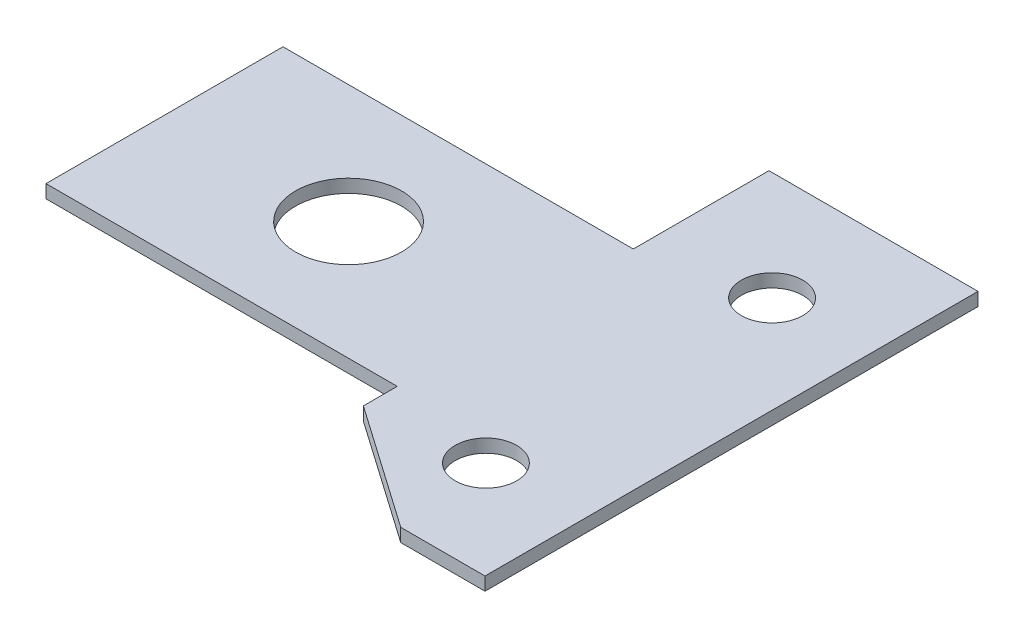
ISO-10303-21;
HEADER;
FILE_DESCRIPTION(('STEP AP214'),'2;1');
FILE_NAME('part.step','',(''),(''),'','','');
FILE_SCHEMA(('AUTOMOTIVE_DESIGN { 1 0 10303 214 1 1 1 1 }'));
ENDSEC;
DATA;
#1=APPLICATION_CONTEXT('core data for automotive mechanical design processes');
#2=APPLICATION_PROTOCOL_DEFINITION('international standard','automotive_design',2000,#1);
#3=PRODUCT_CONTEXT('',#1,'mechanical');
#4=PRODUCT('Part','Part','',(#3));
#5=PRODUCT_RELATED_PRODUCT_CATEGORY('part','',(#4));
#6=PRODUCT_DEFINITION_FORMATION('','',#4);
#7=PRODUCT_DEFINITION_CONTEXT('part definition',#1,'design');
#8=PRODUCT_DEFINITION('design','',#6,#7);
#9=PRODUCT_DEFINITION_SHAPE('','',#8);
#10=(LENGTH_UNIT() NAMED_UNIT(*) SI_UNIT(.MILLI.,.METRE.));
#11=(NAMED_UNIT(*) PLANE_ANGLE_UNIT() SI_UNIT($,.RADIAN.));
#12=(NAMED_UNIT(*) SI_UNIT($,.STERADIAN.) SOLID_ANGLE_UNIT());
#13=UNCERTAINTY_MEASURE_WITH_UNIT(LENGTH_MEASURE(1.E-05),#10,'distance_accuracy_value','');
#14=(GEOMETRIC_REPRESENTATION_CONTEXT(3) GLOBAL_UNCERTAINTY_ASSIGNED_CONTEXT((#13)) GLOBAL_UNIT_ASSIGNED_CONTEXT((#10,
#11,#12)) REPRESENTATION_CONTEXT('',''));
#15=CARTESIAN_POINT('',(0.,0.,0.));
#16=DIRECTION('',(0.,0.,1.));
#17=DIRECTION('',(1.,0.,0.));
#18=AXIS2_PLACEMENT_3D('',#15,#16,#17);
#19=CARTESIAN_POINT('',(27.,-1.016,9.25));
#20=DIRECTION('',(0.,0.,1.));
#21=DIRECTION('',(1.,0.,0.));
#22=AXIS2_PLACEMENT_3D('',#19,#20,#21);
#23=PLANE('',#22);
#24=DIRECTION('',(1.,0.,0.));
#25=VECTOR('',#24,1.);
#26=CARTESIAN_POINT('',(27.,0.,9.25));
#27=LINE('',#26,#25);
#28=CARTESIAN_POINT('',(36.522343864562,0.,9.25));
#29=VERTEX_POINT('',#28);
#30=CARTESIAN_POINT('',(43.,0.,9.25));
#31=VERTEX_POINT('',#30);
#32=EDGE_CURVE('E153',#29,#31,#27,.T.);
#33=ORIENTED_EDGE('',*,*,#32,.F.);
#34=DIRECTION('',(0.,-1.,0.));
#35=VECTOR('',#34,1.);
#36=CARTESIAN_POINT('',(36.522343864562,-1.016,9.25));
#37=LINE('',#36,#35);
#38=CARTESIAN_POINT('',(36.522343864562,-1.016,9.25));
#39=VERTEX_POINT('',#38);
#40=EDGE_CURVE('E54',#39,#29,#37,.F.);
#41=ORIENTED_EDGE('',*,*,#40,.F.);
#42=DIRECTION('',(1.,0.,0.));
#43=VECTOR('',#42,1.);
#44=CARTESIAN_POINT('',(27.,-1.016,9.25));
#45=LINE('',#44,#43);
#46=CARTESIAN_POINT('',(43.,-1.016,9.25));
#47=VERTEX_POINT('',#46);
#48=EDGE_CURVE('E138',#39,#47,#45,.T.);
#49=ORIENTED_EDGE('',*,*,#48,.T.);
#50=DIRECTION('',(0.,1.,0.));
#51=VECTOR('',#50,1.);
#52=CARTESIAN_POINT('',(43.,-1.016,9.25));
#53=LINE('',#52,#51);
#54=EDGE_CURVE('E167',#47,#31,#53,.T.);
#55=ORIENTED_EDGE('',*,*,#54,.T.);
#56=EDGE_LOOP('',(#33,#41,#49,#55));
#57=FACE_BOUND('',#56,.T.);
#58=ADVANCED_FACE('F37',(#57),#23,.T.);
#59=CARTESIAN_POINT('',(27.,-1.016,0.));
#60=DIRECTION('',(-1.,0.,0.));
#61=DIRECTION('',(0.,0.,1.));
#62=AXIS2_PLACEMENT_3D('',#59,#60,#61);
#63=PLANE('',#62);
#64=DIRECTION('',(0.,0.,1.));
#65=VECTOR('',#64,1.);
#66=CARTESIAN_POINT('',(27.,-1.016,0.));
#67=LINE('',#66,#65);
#68=CARTESIAN_POINT('',(27.,-1.016,0.));
#69=VERTEX_POINT('',#68);
#70=CARTESIAN_POINT('',(27.,-1.016,2.59972277137643));
#71=VERTEX_POINT('',#70);
#72=EDGE_CURVE('E213',#69,#71,#67,.T.);
#73=ORIENTED_EDGE('',*,*,#72,.T.);
#74=DIRECTION('',(0.,-1.,0.));
#75=VECTOR('',#74,1.);
#76=CARTESIAN_POINT('',(27.,-1.016,2.59972277137643));
#77=LINE('',#76,#75);
#78=CARTESIAN_POINT('',(27.,0.,2.59972277137643));
#79=VERTEX_POINT('',#78);
#80=EDGE_CURVE('E223',#71,#79,#77,.F.);
#81=ORIENTED_EDGE('',*,*,#80,.T.);
#82=DIRECTION('',(0.,0.,1.));
#83=VECTOR('',#82,1.);
#84=CARTESIAN_POINT('',(27.,0.,0.));
#85=LINE('',#84,#83);
#86=CARTESIAN_POINT('',(27.,0.,0.));
#87=VERTEX_POINT('',#86);
#88=EDGE_CURVE('E150',#87,#79,#85,.T.);
#89=ORIENTED_EDGE('',*,*,#88,.F.);
#90=DIRECTION('',(0.,1.,0.));
#91=VECTOR('',#90,1.);
#92=CARTESIAN_POINT('',(27.,-1.016,0.));
#93=LINE('',#92,#91);
#94=EDGE_CURVE('E169',#69,#87,#93,.T.);
#95=ORIENTED_EDGE('',*,*,#94,.F.);
#96=EDGE_LOOP('',(#73,#81,#89,#95));
#97=FACE_BOUND('',#96,.T.);
#98=ADVANCED_FACE('F184',(#97),#63,.T.);
#99=CARTESIAN_POINT('',(0.,-1.016,0.));
#100=DIRECTION('',(0.,1.,0.));
#101=DIRECTION('',(0.,0.,1.));
#102=AXIS2_PLACEMENT_3D('',#99,#100,#101);
#103=PLANE('',#102);
#104=CARTESIAN_POINT('',(35.5182104349276,-1.016,-20.3020478830707));
#105=DIRECTION('',(0.,1.,0.));
#106=DIRECTION('',(0.,0.,1.));
#107=AXIS2_PLACEMENT_3D('',#104,#105,#106);
#108=CIRCLE('',#107,2.36295847969978);
#109=CARTESIAN_POINT('',(35.5182104349276,-1.016,-17.9390894033709));
#110=VERTEX_POINT('',#109);
#111=EDGE_CURVE('E239',#110,#110,#108,.F.);
#112=ORIENTED_EDGE('',*,*,#111,.F.);
#113=EDGE_LOOP('',(#112));
#114=FACE_BOUND('',#113,.T.);
#115=CARTESIAN_POINT('',(35.5182104349275,-1.016,1.69795211692931));
#116=DIRECTION('',(0.,1.,0.));
#117=DIRECTION('',(0.,0.,1.));
#118=AXIS2_PLACEMENT_3D('',#115,#116,#117);
#119=CIRCLE('',#118,2.36295847969978);
#120=CARTESIAN_POINT('',(35.5182104349275,-1.016,4.0609105966291));
#121=VERTEX_POINT('',#120);
#122=EDGE_CURVE('E232',#121,#121,#119,.F.);
#123=ORIENTED_EDGE('',*,*,#122,.F.);
#124=EDGE_LOOP('',(#123));
#125=FACE_BOUND('',#124,.T.);
#126=CARTESIAN_POINT('',(14.15,-1.016,-9.11));
#127=DIRECTION('',(0.,1.,0.));
#128=DIRECTION('',(0.,0.,1.));
#129=AXIS2_PLACEMENT_3D('',#126,#127,#128);
#130=CIRCLE('',#129,4.075);
#131=CARTESIAN_POINT('',(14.15,-1.016,-5.035));
#132=VERTEX_POINT('',#131);
#133=EDGE_CURVE('E147',#132,#132,#130,.T.);
#134=ORIENTED_EDGE('',*,*,#133,.T.);
#135=EDGE_LOOP('',(#134));
#136=FACE_BOUND('',#135,.T.);
#137=DIRECTION('',(0.819852871112261,0.,0.572574248223741));
#138=VECTOR('',#137,1.);
#139=CARTESIAN_POINT('',(36.522343864562,-1.016,9.25));
#140=LINE('',#139,#138);
#141=EDGE_CURVE('E230',#71,#39,#140,.T.);
#142=ORIENTED_EDGE('',*,*,#141,.F.);
#143=ORIENTED_EDGE('',*,*,#72,.F.);
#144=DIRECTION('',(1.,0.,0.));
#145=VECTOR('',#144,1.);
#146=CARTESIAN_POINT('',(0.,-1.016,0.));
#147=LINE('',#146,#145);
#148=CARTESIAN_POINT('',(0.,-1.016,0.));
#149=VERTEX_POINT('',#148);
#150=EDGE_CURVE('E215',#149,#69,#147,.T.);
#151=ORIENTED_EDGE('',*,*,#150,.F.);
#152=DIRECTION('',(0.,0.,1.));
#153=VECTOR('',#152,1.);
#154=CARTESIAN_POINT('',(0.,-1.016,0.));
#155=LINE('',#154,#153);
#156=CARTESIAN_POINT('',(0.,-1.016,-18.22));
#157=VERTEX_POINT('',#156);
#158=EDGE_CURVE('E163',#157,#149,#155,.T.);
#159=ORIENTED_EDGE('',*,*,#158,.F.);
#160=DIRECTION('',(-1.,0.,0.));
#161=VECTOR('',#160,1.);
#162=CARTESIAN_POINT('',(26.93,-1.016,-18.22));
#163=LINE('',#162,#161);
#164=CARTESIAN_POINT('',(26.93,-1.016,-18.22));
#165=VERTEX_POINT('',#164);
#166=EDGE_CURVE('E132',#165,#157,#163,.T.);
#167=ORIENTED_EDGE('',*,*,#166,.F.);
#168=DIRECTION('',(0.,0.,1.));
#169=VECTOR('',#168,1.);
#170=CARTESIAN_POINT('',(26.93,-1.016,-18.22));
#171=LINE('',#170,#169);
#172=CARTESIAN_POINT('',(26.93,-1.016,-28.65));
#173=VERTEX_POINT('',#172);
#174=EDGE_CURVE('E116',#173,#165,#171,.T.);
#175=ORIENTED_EDGE('',*,*,#174,.F.);
#176=DIRECTION('',(-1.,0.,0.));
#177=VECTOR('',#176,1.);
#178=CARTESIAN_POINT('',(43.,-1.016,-28.65));
#179=LINE('',#178,#177);
#180=CARTESIAN_POINT('',(43.,-1.016,-28.65));
#181=VERTEX_POINT('',#180);
#182=EDGE_CURVE('E131',#181,#173,#179,.T.);
#183=ORIENTED_EDGE('',*,*,#182,.F.);
#184=DIRECTION('',(0.,0.,-1.));
#185=VECTOR('',#184,1.);
#186=CARTESIAN_POINT('',(43.,-1.016,9.25));
#187=LINE('',#186,#185);
#188=EDGE_CURVE('E136',#47,#181,#187,.T.);
#189=ORIENTED_EDGE('',*,*,#188,.F.);
#190=ORIENTED_EDGE('',*,*,#48,.F.);
#191=EDGE_LOOP('',(#142,#143,#151,#159,#167,#175,#183,#189,#190));
#192=FACE_BOUND('',#191,.T.);
#193=ADVANCED_FACE('F129',(#114,#125,#136,#192),#103,.F.);
#194=CARTESIAN_POINT('',(0.,0.,0.));
#195=DIRECTION('',(0.,1.,0.));
#196=DIRECTION('',(0.,0.,1.));
#197=AXIS2_PLACEMENT_3D('',#194,#195,#196);
#198=PLANE('',#197);
#199=CARTESIAN_POINT('',(35.5182104349276,0.,-20.3020478830707));
#200=DIRECTION('',(0.,1.,0.));
#201=DIRECTION('',(0.,0.,1.));
#202=AXIS2_PLACEMENT_3D('',#199,#200,#201);
#203=CIRCLE('',#202,2.36295847969978);
#204=CARTESIAN_POINT('',(35.5182104349276,0.,-17.9390894033709));
#205=VERTEX_POINT('',#204);
#206=EDGE_CURVE('E242',#205,#205,#203,.T.);
#207=ORIENTED_EDGE('',*,*,#206,.F.);
#208=EDGE_LOOP('',(#207));
#209=FACE_BOUND('',#208,.T.);
#210=CARTESIAN_POINT('',(35.5182104349275,0.,1.69795211692931));
#211=DIRECTION('',(0.,1.,0.));
#212=DIRECTION('',(0.,0.,1.));
#213=AXIS2_PLACEMENT_3D('',#210,#211,#212);
#214=CIRCLE('',#213,2.36295847969978);
#215=CARTESIAN_POINT('',(35.5182104349275,0.,4.0609105966291));
#216=VERTEX_POINT('',#215);
#217=EDGE_CURVE('E236',#216,#216,#214,.T.);
#218=ORIENTED_EDGE('',*,*,#217,.F.);
#219=EDGE_LOOP('',(#218));
#220=FACE_BOUND('',#219,.T.);
#221=CARTESIAN_POINT('',(14.15,0.,-9.11));
#222=DIRECTION('',(0.,1.,0.));
#223=DIRECTION('',(0.,0.,1.));
#224=AXIS2_PLACEMENT_3D('',#221,#222,#223);
#225=CIRCLE('',#224,4.075);
#226=CARTESIAN_POINT('',(14.15,0.,-5.035));
#227=VERTEX_POINT('',#226);
#228=EDGE_CURVE('E220',#227,#227,#225,.T.);
#229=ORIENTED_EDGE('',*,*,#228,.F.);
#230=EDGE_LOOP('',(#229));
#231=FACE_BOUND('',#230,.T.);
#232=ORIENTED_EDGE('',*,*,#88,.T.);
#233=DIRECTION('',(0.819852871112261,0.,0.572574248223741));
#234=VECTOR('',#233,1.);
#235=CARTESIAN_POINT('',(36.522343864562,0.,9.25));
#236=LINE('',#235,#234);
#237=EDGE_CURVE('E227',#79,#29,#236,.T.);
#238=ORIENTED_EDGE('',*,*,#237,.T.);
#239=ORIENTED_EDGE('',*,*,#32,.T.);
#240=DIRECTION('',(0.,0.,-1.));
#241=VECTOR('',#240,1.);
#242=CARTESIAN_POINT('',(43.,0.,-28.65));
#243=LINE('',#242,#241);
#244=CARTESIAN_POINT('',(43.,0.,-28.65));
#245=VERTEX_POINT('',#244);
#246=EDGE_CURVE('E155',#31,#245,#243,.T.);
#247=ORIENTED_EDGE('',*,*,#246,.T.);
#248=DIRECTION('',(-1.,0.,0.));
#249=VECTOR('',#248,1.);
#250=CARTESIAN_POINT('',(43.,0.,-28.65));
#251=LINE('',#250,#249);
#252=CARTESIAN_POINT('',(26.93,0.,-28.65));
#253=VERTEX_POINT('',#252);
#254=EDGE_CURVE('E158',#245,#253,#251,.T.);
#255=ORIENTED_EDGE('',*,*,#254,.T.);
#256=DIRECTION('',(0.,0.,1.));
#257=VECTOR('',#256,1.);
#258=CARTESIAN_POINT('',(26.93,0.,-18.22));
#259=LINE('',#258,#257);
#260=CARTESIAN_POINT('',(26.93,0.,-18.22));
#261=VERTEX_POINT('',#260);
#262=EDGE_CURVE('E119',#253,#261,#259,.T.);
#263=ORIENTED_EDGE('',*,*,#262,.T.);
#264=DIRECTION('',(-1.,0.,0.));
#265=VECTOR('',#264,1.);
#266=CARTESIAN_POINT('',(26.93,0.,-18.22));
#267=LINE('',#266,#265);
#268=CARTESIAN_POINT('',(0.,0.,-18.22));
#269=VERTEX_POINT('',#268);
#270=EDGE_CURVE('E161',#261,#269,#267,.T.);
#271=ORIENTED_EDGE('',*,*,#270,.T.);
#272=DIRECTION('',(0.,0.,1.));
#273=VECTOR('',#272,1.);
#274=CARTESIAN_POINT('',(0.,0.,0.));
#275=LINE('',#274,#273);
#276=CARTESIAN_POINT('',(0.,0.,0.));
#277=VERTEX_POINT('',#276);
#278=EDGE_CURVE('E143',#269,#277,#275,.T.);
#279=ORIENTED_EDGE('',*,*,#278,.T.);
#280=DIRECTION('',(1.,0.,0.));
#281=VECTOR('',#280,1.);
#282=CARTESIAN_POINT('',(0.,0.,0.));
#283=LINE('',#282,#281);
#284=EDGE_CURVE('E146',#277,#87,#283,.T.);
#285=ORIENTED_EDGE('',*,*,#284,.T.);
#286=EDGE_LOOP('',(#232,#238,#239,#247,#255,#263,#271,#279,#285));
#287=FACE_BOUND('',#286,.T.);
#288=ADVANCED_FACE('F173',(#209,#220,#231,#287),#198,.T.);
#289=CARTESIAN_POINT('',(0.,-1.016,0.));
#290=DIRECTION('',(-1.,0.,0.));
#291=DIRECTION('',(0.,0.,1.));
#292=AXIS2_PLACEMENT_3D('',#289,#290,#291);
#293=PLANE('',#292);
#294=ORIENTED_EDGE('',*,*,#278,.F.);
#295=DIRECTION('',(0.,1.,0.));
#296=VECTOR('',#295,1.);
#297=CARTESIAN_POINT('',(0.,-1.016,-18.22));
#298=LINE('',#297,#296);
#299=EDGE_CURVE('E11',#157,#269,#298,.T.);
#300=ORIENTED_EDGE('',*,*,#299,.F.);
#301=ORIENTED_EDGE('',*,*,#158,.T.);
#302=DIRECTION('',(0.,1.,0.));
#303=VECTOR('',#302,1.);
#304=CARTESIAN_POINT('',(0.,-1.016,0.));
#305=LINE('',#304,#303);
#306=EDGE_CURVE('E41',#149,#277,#305,.T.);
#307=ORIENTED_EDGE('',*,*,#306,.T.);
#308=EDGE_LOOP('',(#294,#300,#301,#307));
#309=FACE_BOUND('',#308,.T.);
#310=ADVANCED_FACE('F39',(#309),#293,.T.);
#311=CARTESIAN_POINT('',(26.93,-1.016,-18.22));
#312=DIRECTION('',(0.,0.,-1.));
#313=DIRECTION('',(-1.,0.,0.));
#314=AXIS2_PLACEMENT_3D('',#311,#312,#313);
#315=PLANE('',#314);
#316=ORIENTED_EDGE('',*,*,#270,.F.);
#317=DIRECTION('',(0.,1.,0.));
#318=VECTOR('',#317,1.);
#319=CARTESIAN_POINT('',(26.93,-1.016,-18.22));
#320=LINE('',#319,#318);
#321=EDGE_CURVE('E46',#165,#261,#320,.T.);
#322=ORIENTED_EDGE('',*,*,#321,.F.);
#323=ORIENTED_EDGE('',*,*,#166,.T.);
#324=ORIENTED_EDGE('',*,*,#299,.T.);
#325=EDGE_LOOP('',(#316,#322,#323,#324));
#326=FACE_BOUND('',#325,.T.);
#327=ADVANCED_FACE('F174',(#326),#315,.T.);
#328=CARTESIAN_POINT('',(26.93,-1.016,-18.22));
#329=DIRECTION('',(-1.,0.,0.));
#330=DIRECTION('',(0.,0.,1.));
#331=AXIS2_PLACEMENT_3D('',#328,#329,#330);
#332=PLANE('',#331);
#333=ORIENTED_EDGE('',*,*,#262,.F.);
#334=DIRECTION('',(0.,1.,0.));
#335=VECTOR('',#334,1.);
#336=CARTESIAN_POINT('',(26.93,-1.016,-28.65));
#337=LINE('',#336,#335);
#338=EDGE_CURVE('E113',#173,#253,#337,.T.);
#339=ORIENTED_EDGE('',*,*,#338,.F.);
#340=ORIENTED_EDGE('',*,*,#174,.T.);
#341=ORIENTED_EDGE('',*,*,#321,.T.);
#342=EDGE_LOOP('',(#333,#339,#340,#341));
#343=FACE_BOUND('',#342,.T.);
#344=ADVANCED_FACE('F115',(#343),#332,.T.);
#345=CARTESIAN_POINT('',(43.,-1.016,-28.65));
#346=DIRECTION('',(0.,0.,-1.));
#347=DIRECTION('',(-1.,0.,0.));
#348=AXIS2_PLACEMENT_3D('',#345,#346,#347);
#349=PLANE('',#348);
#350=ORIENTED_EDGE('',*,*,#254,.F.);
#351=DIRECTION('',(0.,1.,0.));
#352=VECTOR('',#351,1.);
#353=CARTESIAN_POINT('',(43.,-1.016,-28.65));
#354=LINE('',#353,#352);
#355=EDGE_CURVE('E124',#181,#245,#354,.T.);
#356=ORIENTED_EDGE('',*,*,#355,.F.);
#357=ORIENTED_EDGE('',*,*,#182,.T.);
#358=ORIENTED_EDGE('',*,*,#338,.T.);
#359=EDGE_LOOP('',(#350,#356,#357,#358));
#360=FACE_BOUND('',#359,.T.);
#361=ADVANCED_FACE('F135',(#360),#349,.T.);
#362=CARTESIAN_POINT('',(43.,-1.016,-28.65));
#363=DIRECTION('',(1.,0.,0.));
#364=DIRECTION('',(0.,0.,-1.));
#365=AXIS2_PLACEMENT_3D('',#362,#363,#364);
#366=PLANE('',#365);
#367=ORIENTED_EDGE('',*,*,#246,.F.);
#368=ORIENTED_EDGE('',*,*,#54,.F.);
#369=ORIENTED_EDGE('',*,*,#188,.T.);
#370=ORIENTED_EDGE('',*,*,#355,.T.);
#371=EDGE_LOOP('',(#367,#368,#369,#370));
#372=FACE_BOUND('',#371,.T.);
#373=ADVANCED_FACE('F194',(#372),#366,.T.);
#374=CARTESIAN_POINT('',(0.,-1.016,0.));
#375=DIRECTION('',(0.,0.,1.));
#376=DIRECTION('',(1.,0.,0.));
#377=AXIS2_PLACEMENT_3D('',#374,#375,#376);
#378=PLANE('',#377);
#379=ORIENTED_EDGE('',*,*,#284,.F.);
#380=ORIENTED_EDGE('',*,*,#306,.F.);
#381=ORIENTED_EDGE('',*,*,#150,.T.);
#382=ORIENTED_EDGE('',*,*,#94,.T.);
#383=EDGE_LOOP('',(#379,#380,#381,#382));
#384=FACE_BOUND('',#383,.T.);
#385=ADVANCED_FACE('F171',(#384),#378,.T.);
#386=CARTESIAN_POINT('',(14.15,-1.016,-9.11));
#387=DIRECTION('',(0.,1.,0.));
#388=DIRECTION('',(0.,0.,1.));
#389=AXIS2_PLACEMENT_3D('',#386,#387,#388);
#390=CYLINDRICAL_SURFACE('',#389,4.075);
#391=ORIENTED_EDGE('',*,*,#133,.F.);
#392=EDGE_LOOP('',(#391));
#393=FACE_BOUND('',#392,.T.);
#394=ORIENTED_EDGE('',*,*,#228,.T.);
#395=EDGE_LOOP('',(#394));
#396=FACE_BOUND('',#395,.T.);
#397=ADVANCED_FACE('F197',(#393,#396),#390,.F.);
#398=CARTESIAN_POINT('',(36.522343864562,-1.016,9.25));
#399=DIRECTION('',(-0.572574248223741,0.,0.819852871112261));
#400=DIRECTION('',(0.819852871112261,0.,0.572574248223741));
#401=AXIS2_PLACEMENT_3D('',#398,#399,#400);
#402=PLANE('',#401);
#403=ORIENTED_EDGE('',*,*,#80,.F.);
#404=ORIENTED_EDGE('',*,*,#141,.T.);
#405=ORIENTED_EDGE('',*,*,#40,.T.);
#406=ORIENTED_EDGE('',*,*,#237,.F.);
#407=EDGE_LOOP('',(#403,#404,#405,#406));
#408=FACE_BOUND('',#407,.T.);
#409=ADVANCED_FACE('F202',(#408),#402,.T.);
#410=CARTESIAN_POINT('',(35.5182104349275,-1.017,1.69795211692931));
#411=DIRECTION('',(0.,1.,0.));
#412=DIRECTION('',(0.,0.,1.));
#413=AXIS2_PLACEMENT_3D('',#410,#411,#412);
#414=CYLINDRICAL_SURFACE('',#413,2.36295847969978);
#415=ORIENTED_EDGE('',*,*,#217,.T.);
#416=EDGE_LOOP('',(#415));
#417=FACE_BOUND('',#416,.T.);
#418=ORIENTED_EDGE('',*,*,#122,.T.);
#419=EDGE_LOOP('',(#418));
#420=FACE_BOUND('',#419,.T.);
#421=ADVANCED_FACE('F256',(#417,#420),#414,.F.);
#422=CARTESIAN_POINT('',(35.5182104349276,-1.017,-20.3020478830707));
#423=DIRECTION('',(0.,1.,0.));
#424=DIRECTION('',(0.,0.,1.));
#425=AXIS2_PLACEMENT_3D('',#422,#423,#424);
#426=CYLINDRICAL_SURFACE('',#425,2.36295847969978);
#427=ORIENTED_EDGE('',*,*,#206,.T.);
#428=EDGE_LOOP('',(#427));
#429=FACE_BOUND('',#428,.T.);
#430=ORIENTED_EDGE('',*,*,#111,.T.);
#431=EDGE_LOOP('',(#430));
#432=FACE_BOUND('',#431,.T.);
#433=ADVANCED_FACE('F246',(#429,#432),#426,.F.);
#434=CLOSED_SHELL('',(#58,#98,#193,#288,#310,#327,#344,#361,#373,#385,#397,#409,#421,#433));
#435=MANIFOLD_SOLID_BREP('B2',#434);
#436=ADVANCED_BREP_SHAPE_REPRESENTATION('',(#18,#435),#14);
#437=SHAPE_DEFINITION_REPRESENTATION(#9,#436);
ENDSEC;
END-ISO-10303-21;
